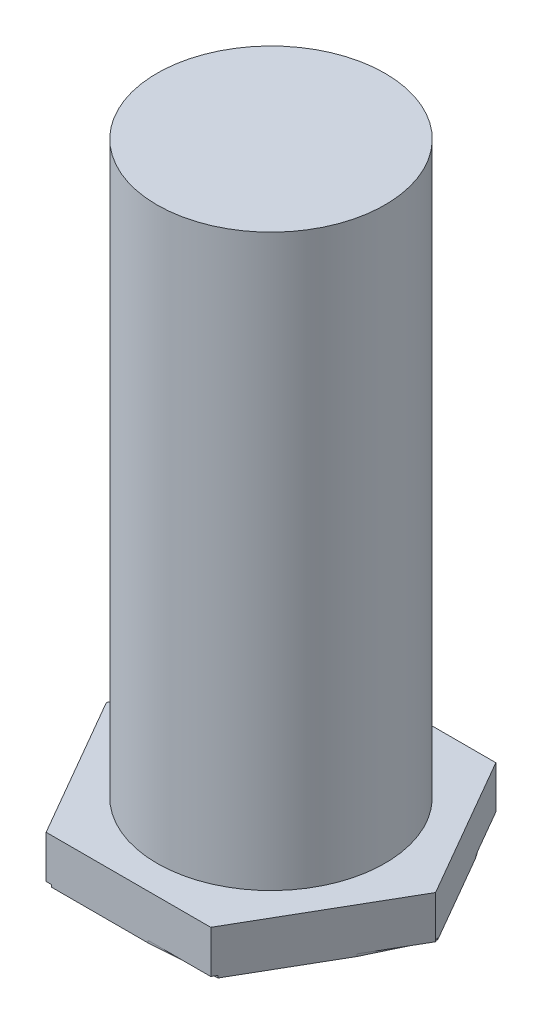
ISO-10303-21;
HEADER;
FILE_DESCRIPTION(('STEP AP214'),'2;1');
FILE_NAME('part.step','',(''),(''),'','','');
FILE_SCHEMA(('AUTOMOTIVE_DESIGN { 1 0 10303 214 1 1 1 1 }'));
ENDSEC;
DATA;
#1=APPLICATION_CONTEXT('core data for automotive mechanical design processes');
#2=APPLICATION_PROTOCOL_DEFINITION('international standard','automotive_design',2000,#1);
#3=PRODUCT_CONTEXT('',#1,'mechanical');
#4=PRODUCT('Part','Part','',(#3));
#5=PRODUCT_RELATED_PRODUCT_CATEGORY('part','',(#4));
#6=PRODUCT_DEFINITION_FORMATION('','',#4);
#7=PRODUCT_DEFINITION_CONTEXT('part definition',#1,'design');
#8=PRODUCT_DEFINITION('design','',#6,#7);
#9=PRODUCT_DEFINITION_SHAPE('','',#8);
#10=(LENGTH_UNIT() NAMED_UNIT(*) SI_UNIT(.MILLI.,.METRE.));
#11=(NAMED_UNIT(*) PLANE_ANGLE_UNIT() SI_UNIT($,.RADIAN.));
#12=(NAMED_UNIT(*) SI_UNIT($,.STERADIAN.) SOLID_ANGLE_UNIT());
#13=UNCERTAINTY_MEASURE_WITH_UNIT(LENGTH_MEASURE(1.E-05),#10,'distance_accuracy_value','');
#14=(GEOMETRIC_REPRESENTATION_CONTEXT(3) GLOBAL_UNCERTAINTY_ASSIGNED_CONTEXT((#13)) GLOBAL_UNIT_ASSIGNED_CONTEXT((#10,
#11,#12)) REPRESENTATION_CONTEXT('',''));
#15=CARTESIAN_POINT('',(0.,0.,0.));
#16=DIRECTION('',(0.,0.,1.));
#17=DIRECTION('',(1.,0.,0.));
#18=AXIS2_PLACEMENT_3D('',#15,#16,#17);
#19=CARTESIAN_POINT('',(0.,25.4,0.));
#20=DIRECTION('',(0.,-1.,0.));
#21=DIRECTION('',(0.,0.,-1.));
#22=AXIS2_PLACEMENT_3D('',#19,#20,#21);
#23=CYLINDRICAL_SURFACE('',#22,5.08);
#24=CARTESIAN_POINT('',(0.,25.4,0.));
#25=DIRECTION('',(0.,1.,0.));
#26=DIRECTION('',(0.,0.,1.));
#27=AXIS2_PLACEMENT_3D('',#24,#25,#26);
#28=CIRCLE('',#27,5.08);
#29=CARTESIAN_POINT('',(0.,25.4,5.08));
#30=VERTEX_POINT('',#29);
#31=EDGE_CURVE('E11',#30,#30,#28,.T.);
#32=ORIENTED_EDGE('',*,*,#31,.F.);
#33=EDGE_LOOP('',(#32));
#34=FACE_BOUND('',#33,.T.);
#35=CARTESIAN_POINT('',(0.,0.,0.));
#36=DIRECTION('',(0.,1.,0.));
#37=DIRECTION('',(0.,0.,1.));
#38=AXIS2_PLACEMENT_3D('',#35,#36,#37);
#39=CIRCLE('',#38,5.08);
#40=CARTESIAN_POINT('',(0.,0.,5.08));
#41=VERTEX_POINT('',#40);
#42=EDGE_CURVE('E42',#41,#41,#39,.T.);
#43=ORIENTED_EDGE('',*,*,#42,.T.);
#44=EDGE_LOOP('',(#43));
#45=FACE_BOUND('',#44,.T.);
#46=ADVANCED_FACE('F39',(#34,#45),#23,.T.);
#47=CARTESIAN_POINT('',(0.,25.4,0.));
#48=DIRECTION('',(0.,1.,0.));
#49=DIRECTION('',(0.,0.,1.));
#50=AXIS2_PLACEMENT_3D('',#47,#48,#49);
#51=PLANE('',#50);
#52=ORIENTED_EDGE('',*,*,#31,.T.);
#53=EDGE_LOOP('',(#52));
#54=FACE_BOUND('',#53,.T.);
#55=ADVANCED_FACE('F416',(#54),#51,.T.);
#56=CARTESIAN_POINT('',(-3.66617420935413,-2.,6.35));
#57=DIRECTION('',(0.866025403784439,0.,-0.5));
#58=DIRECTION('',(-0.5,0.,-0.866025403784439));
#59=AXIS2_PLACEMENT_3D('',#56,#57,#58);
#60=PLANE('',#59);
#61=DIRECTION('',(-0.500000000000006,0.,-0.866025403784435));
#62=VECTOR('',#61,1.);
#63=CARTESIAN_POINT('',(-7.33234841870825,-1.9,0.));
#64=LINE('',#63,#62);
#65=CARTESIAN_POINT('',(-7.21094186725373,-1.9,0.210282315490945));
#66=VERTEX_POINT('',#65);
#67=CARTESIAN_POINT('',(-7.33234841870825,-1.9,0.));
#68=VERTEX_POINT('',#67);
#69=EDGE_CURVE('E266',#66,#68,#64,.T.);
#70=ORIENTED_EDGE('',*,*,#69,.F.);
#71=DIRECTION('',(0.,-1.,0.));
#72=VECTOR('',#71,1.);
#73=CARTESIAN_POINT('',(-7.21094186725373,-1.9,0.210282315490945));
#74=LINE('',#73,#72);
#75=CARTESIAN_POINT('',(-7.21094186725373,-2.,0.210282315490945));
#76=VERTEX_POINT('',#75);
#77=EDGE_CURVE('E251',#66,#76,#74,.T.);
#78=ORIENTED_EDGE('',*,*,#77,.T.);
#79=DIRECTION('',(-0.5,0.,-0.866025403784438));
#80=VECTOR('',#79,1.);
#81=CARTESIAN_POINT('',(-3.66617420935413,-2.,6.35));
#82=LINE('',#81,#80);
#83=CARTESIAN_POINT('',(-4.97956213715095,-2.,4.07514537900829));
#84=VERTEX_POINT('',#83);
#85=EDGE_CURVE('E297',#84,#76,#82,.T.);
#86=ORIENTED_EDGE('',*,*,#85,.F.);
#87=DIRECTION('',(0.,-1.,0.));
#88=VECTOR('',#87,1.);
#89=CARTESIAN_POINT('',(-4.97956213715102,-1.9,4.07514537900817));
#90=LINE('',#89,#88);
#91=CARTESIAN_POINT('',(-4.97956213715102,-1.9,4.07514537900817));
#92=VERTEX_POINT('',#91);
#93=EDGE_CURVE('E288',#92,#84,#90,.T.);
#94=ORIENTED_EDGE('',*,*,#93,.F.);
#95=DIRECTION('',(-0.5,0.,-0.866025403784439));
#96=VECTOR('',#95,1.);
#97=CARTESIAN_POINT('',(-3.66617420935413,-1.9,6.35));
#98=LINE('',#97,#96);
#99=CARTESIAN_POINT('',(-3.66617420935413,-1.9,6.35));
#100=VERTEX_POINT('',#99);
#101=EDGE_CURVE('E277',#100,#92,#98,.T.);
#102=ORIENTED_EDGE('',*,*,#101,.F.);
#103=DIRECTION('',(0.,1.,0.));
#104=VECTOR('',#103,1.);
#105=CARTESIAN_POINT('',(-3.66617420935413,-2.,6.35));
#106=LINE('',#105,#104);
#107=CARTESIAN_POINT('',(-3.66617420935413,0.,6.35));
#108=VERTEX_POINT('',#107);
#109=EDGE_CURVE('E320',#100,#108,#106,.T.);
#110=ORIENTED_EDGE('',*,*,#109,.T.);
#111=DIRECTION('',(-0.5,0.,-0.866025403784438));
#112=VECTOR('',#111,1.);
#113=CARTESIAN_POINT('',(-3.66617420935413,0.,6.35));
#114=LINE('',#113,#112);
#115=CARTESIAN_POINT('',(-7.33234841870825,0.,0.));
#116=VERTEX_POINT('',#115);
#117=EDGE_CURVE('E294',#108,#116,#114,.T.);
#118=ORIENTED_EDGE('',*,*,#117,.T.);
#119=DIRECTION('',(0.,1.,0.));
#120=VECTOR('',#119,1.);
#121=CARTESIAN_POINT('',(-7.33234841870825,-2.,0.));
#122=LINE('',#121,#120);
#123=EDGE_CURVE('E357',#68,#116,#122,.T.);
#124=ORIENTED_EDGE('',*,*,#123,.F.);
#125=EDGE_LOOP('',(#70,#78,#86,#94,#102,#110,#118,#124));
#126=FACE_BOUND('',#125,.T.);
#127=ADVANCED_FACE('F380',(#126),#60,.F.);
#128=CARTESIAN_POINT('',(-7.33234841870825,-2.,0.));
#129=DIRECTION('',(0.866025403784439,0.,0.5));
#130=DIRECTION('',(0.5,0.,-0.866025403784439));
#131=AXIS2_PLACEMENT_3D('',#128,#129,#130);
#132=PLANE('',#131);
#133=DIRECTION('',(0.5,0.,-0.866025403784439));
#134=VECTOR('',#133,1.);
#135=CARTESIAN_POINT('',(-7.33234841870825,-2.,0.));
#136=LINE('',#135,#134);
#137=CARTESIAN_POINT('',(-6.07045658023057,-2.,-2.18566077789983));
#138=VERTEX_POINT('',#137);
#139=CARTESIAN_POINT('',(-3.78759409930868,-2.,-6.13969458154929));
#140=VERTEX_POINT('',#139);
#141=EDGE_CURVE('E301',#138,#140,#136,.T.);
#142=ORIENTED_EDGE('',*,*,#141,.F.);
#143=DIRECTION('',(0.,-1.,0.));
#144=VECTOR('',#143,1.);
#145=CARTESIAN_POINT('',(-6.07045658023058,-1.9,-2.18566077789981));
#146=LINE('',#145,#144);
#147=CARTESIAN_POINT('',(-6.07045658023058,-1.9,-2.18566077789981));
#148=VERTEX_POINT('',#147);
#149=EDGE_CURVE('E269',#148,#138,#146,.T.);
#150=ORIENTED_EDGE('',*,*,#149,.F.);
#151=DIRECTION('',(0.5,0.,-0.866025403784438));
#152=VECTOR('',#151,1.);
#153=CARTESIAN_POINT('',(-6.07045658023058,-1.9,-2.18566077789981));
#154=LINE('',#153,#152);
#155=EDGE_CURVE('E257',#68,#148,#154,.T.);
#156=ORIENTED_EDGE('',*,*,#155,.F.);
#157=ORIENTED_EDGE('',*,*,#123,.T.);
#158=DIRECTION('',(0.5,0.,-0.866025403784439));
#159=VECTOR('',#158,1.);
#160=CARTESIAN_POINT('',(-7.33234841870825,0.,0.));
#161=LINE('',#160,#159);
#162=CARTESIAN_POINT('',(-3.66617420935413,0.,-6.35));
#163=VERTEX_POINT('',#162);
#164=EDGE_CURVE('E324',#116,#163,#161,.T.);
#165=ORIENTED_EDGE('',*,*,#164,.T.);
#166=DIRECTION('',(0.,1.,0.));
#167=VECTOR('',#166,1.);
#168=CARTESIAN_POINT('',(-3.66617420935413,-2.,-6.35));
#169=LINE('',#168,#167);
#170=CARTESIAN_POINT('',(-3.66617420935413,-1.9,-6.35));
#171=VERTEX_POINT('',#170);
#172=EDGE_CURVE('E354',#171,#163,#169,.T.);
#173=ORIENTED_EDGE('',*,*,#172,.F.);
#174=DIRECTION('',(0.499999999999995,0.,-0.866025403784442));
#175=VECTOR('',#174,1.);
#176=CARTESIAN_POINT('',(-3.78759409930868,-1.9,-6.13969458154929));
#177=LINE('',#176,#175);
#178=CARTESIAN_POINT('',(-3.78759409930868,-1.9,-6.13969458154929));
#179=VERTEX_POINT('',#178);
#180=EDGE_CURVE('E245',#179,#171,#177,.T.);
#181=ORIENTED_EDGE('',*,*,#180,.F.);
#182=DIRECTION('',(0.,-1.,0.));
#183=VECTOR('',#182,1.);
#184=CARTESIAN_POINT('',(-3.78759409930868,-1.9,-6.13969458154929));
#185=LINE('',#184,#183);
#186=EDGE_CURVE('E230',#179,#140,#185,.T.);
#187=ORIENTED_EDGE('',*,*,#186,.T.);
#188=EDGE_LOOP('',(#142,#150,#156,#157,#165,#173,#181,#187));
#189=FACE_BOUND('',#188,.T.);
#190=ADVANCED_FACE('F407',(#189),#132,.F.);
#191=CARTESIAN_POINT('',(-3.66617420935413,-2.,-6.35));
#192=DIRECTION('',(0.,0.,1.));
#193=DIRECTION('',(1.,0.,0.));
#194=AXIS2_PLACEMENT_3D('',#191,#192,#193);
#195=PLANE('',#194);
#196=DIRECTION('',(1.,0.,0.));
#197=VECTOR('',#196,1.);
#198=CARTESIAN_POINT('',(-3.66617420935413,-2.,-6.35));
#199=LINE('',#198,#197);
#200=CARTESIAN_POINT('',(-1.14744564717966,-2.,-6.35));
#201=VERTEX_POINT('',#200);
#202=CARTESIAN_POINT('',(3.42320375409706,-2.,-6.35));
#203=VERTEX_POINT('',#202);
#204=EDGE_CURVE('E306',#201,#203,#199,.T.);
#205=ORIENTED_EDGE('',*,*,#204,.F.);
#206=DIRECTION('',(0.,-1.,0.));
#207=VECTOR('',#206,1.);
#208=CARTESIAN_POINT('',(-1.14744564717976,-1.9,-6.35));
#209=LINE('',#208,#207);
#210=CARTESIAN_POINT('',(-1.14744564717976,-1.9,-6.35));
#211=VERTEX_POINT('',#210);
#212=EDGE_CURVE('E248',#211,#201,#209,.T.);
#213=ORIENTED_EDGE('',*,*,#212,.F.);
#214=DIRECTION('',(1.,0.,0.));
#215=VECTOR('',#214,1.);
#216=CARTESIAN_POINT('',(-3.66617420935413,-1.9,-6.35));
#217=LINE('',#216,#215);
#218=EDGE_CURVE('E236',#171,#211,#217,.T.);
#219=ORIENTED_EDGE('',*,*,#218,.F.);
#220=ORIENTED_EDGE('',*,*,#172,.T.);
#221=DIRECTION('',(1.,0.,0.));
#222=VECTOR('',#221,1.);
#223=CARTESIAN_POINT('',(-3.66617420935413,0.,-6.35));
#224=LINE('',#223,#222);
#225=CARTESIAN_POINT('',(3.66617420935412,0.,-6.35));
#226=VERTEX_POINT('',#225);
#227=EDGE_CURVE('E328',#163,#226,#224,.T.);
#228=ORIENTED_EDGE('',*,*,#227,.T.);
#229=DIRECTION('',(0.,1.,0.));
#230=VECTOR('',#229,1.);
#231=CARTESIAN_POINT('',(3.66617420935412,-2.,-6.35));
#232=LINE('',#231,#230);
#233=CARTESIAN_POINT('',(3.66617420935412,-1.9,-6.35));
#234=VERTEX_POINT('',#233);
#235=EDGE_CURVE('E351',#234,#226,#232,.T.);
#236=ORIENTED_EDGE('',*,*,#235,.F.);
#237=DIRECTION('',(1.,0.,0.));
#238=VECTOR('',#237,1.);
#239=CARTESIAN_POINT('',(3.66617420935412,-1.9,-6.35));
#240=LINE('',#239,#238);
#241=CARTESIAN_POINT('',(3.42320375409706,-1.9,-6.35));
#242=VERTEX_POINT('',#241);
#243=EDGE_CURVE('E224',#242,#234,#240,.T.);
#244=ORIENTED_EDGE('',*,*,#243,.F.);
#245=DIRECTION('',(0.,-1.,0.));
#246=VECTOR('',#245,1.);
#247=CARTESIAN_POINT('',(3.42320375409706,-1.9,-6.35));
#248=LINE('',#247,#246);
#249=EDGE_CURVE('E208',#242,#203,#248,.T.);
#250=ORIENTED_EDGE('',*,*,#249,.T.);
#251=EDGE_LOOP('',(#205,#213,#219,#220,#228,#236,#244,#250));
#252=FACE_BOUND('',#251,.T.);
#253=ADVANCED_FACE('F401',(#252),#195,.F.);
#254=CARTESIAN_POINT('',(3.66617420935412,-2.,-6.35));
#255=DIRECTION('',(-0.866025403784439,0.,0.5));
#256=DIRECTION('',(0.5,0.,0.866025403784439));
#257=AXIS2_PLACEMENT_3D('',#254,#255,#256);
#258=PLANE('',#257);
#259=DIRECTION('',(0.5,0.,0.866025403784438));
#260=VECTOR('',#259,1.);
#261=CARTESIAN_POINT('',(3.66617420935412,-2.,-6.35));
#262=LINE('',#261,#260);
#263=CARTESIAN_POINT('',(4.91331884959129,-2.,-4.18988211872199));
#264=VERTEX_POINT('',#263);
#265=CARTESIAN_POINT('',(7.21103458263856,-2.,-0.210121727733769));
#266=VERTEX_POINT('',#265);
#267=EDGE_CURVE('E310',#264,#266,#262,.T.);
#268=ORIENTED_EDGE('',*,*,#267,.F.);
#269=DIRECTION('',(0.,-1.,0.));
#270=VECTOR('',#269,1.);
#271=CARTESIAN_POINT('',(4.91331884959143,-1.9,-4.18988211872177));
#272=LINE('',#271,#270);
#273=CARTESIAN_POINT('',(4.91331884959143,-1.9,-4.18988211872177));
#274=VERTEX_POINT('',#273);
#275=EDGE_CURVE('E227',#274,#264,#272,.T.);
#276=ORIENTED_EDGE('',*,*,#275,.F.);
#277=DIRECTION('',(0.5,0.,0.866025403784439));
#278=VECTOR('',#277,1.);
#279=CARTESIAN_POINT('',(4.91331884959143,-1.9,-4.18988211872177));
#280=LINE('',#279,#278);
#281=EDGE_CURVE('E215',#234,#274,#280,.T.);
#282=ORIENTED_EDGE('',*,*,#281,.F.);
#283=ORIENTED_EDGE('',*,*,#235,.T.);
#284=DIRECTION('',(0.5,0.,0.866025403784438));
#285=VECTOR('',#284,1.);
#286=CARTESIAN_POINT('',(3.66617420935412,0.,-6.35));
#287=LINE('',#286,#285);
#288=CARTESIAN_POINT('',(7.33234841870825,0.,0.));
#289=VERTEX_POINT('',#288);
#290=EDGE_CURVE('E332',#226,#289,#287,.T.);
#291=ORIENTED_EDGE('',*,*,#290,.T.);
#292=DIRECTION('',(0.,1.,0.));
#293=VECTOR('',#292,1.);
#294=CARTESIAN_POINT('',(7.33234841870825,-2.,0.));
#295=LINE('',#294,#293);
#296=CARTESIAN_POINT('',(7.33234841870825,-1.9,0.));
#297=VERTEX_POINT('',#296);
#298=EDGE_CURVE('E348',#297,#289,#295,.T.);
#299=ORIENTED_EDGE('',*,*,#298,.F.);
#300=DIRECTION('',(0.500000000000002,0.,0.866025403784438));
#301=VECTOR('',#300,1.);
#302=CARTESIAN_POINT('',(7.21103458263856,-1.9,-0.210121727733769));
#303=LINE('',#302,#301);
#304=CARTESIAN_POINT('',(7.21103458263856,-1.9,-0.210121727733769));
#305=VERTEX_POINT('',#304);
#306=EDGE_CURVE('E203',#305,#297,#303,.T.);
#307=ORIENTED_EDGE('',*,*,#306,.F.);
#308=DIRECTION('',(0.,-1.,0.));
#309=VECTOR('',#308,1.);
#310=CARTESIAN_POINT('',(7.21103458263856,-1.9,-0.210121727733769));
#311=LINE('',#310,#309);
#312=EDGE_CURVE('E209',#305,#266,#311,.T.);
#313=ORIENTED_EDGE('',*,*,#312,.T.);
#314=EDGE_LOOP('',(#268,#276,#282,#283,#291,#299,#307,#313));
#315=FACE_BOUND('',#314,.T.);
#316=ADVANCED_FACE('F393',(#315),#258,.F.);
#317=CARTESIAN_POINT('',(7.33234841870825,-2.,0.));
#318=DIRECTION('',(-0.866025403784439,0.,-0.5));
#319=DIRECTION('',(-0.5,0.,0.866025403784439));
#320=AXIS2_PLACEMENT_3D('',#317,#318,#319);
#321=PLANE('',#320);
#322=DIRECTION('',(-0.5,0.,0.866025403784439));
#323=VECTOR('',#322,1.);
#324=CARTESIAN_POINT('',(7.33234841870825,-2.,0.));
#325=LINE('',#324,#323);
#326=CARTESIAN_POINT('',(6.05256982189205,-2.,2.21664155212486));
#327=VERTEX_POINT('',#326);
#328=CARTESIAN_POINT('',(3.78693067363508,-2.,6.140843668523));
#329=VERTEX_POINT('',#328);
#330=EDGE_CURVE('E314',#327,#329,#325,.T.);
#331=ORIENTED_EDGE('',*,*,#330,.F.);
#332=DIRECTION('',(0.,-1.,0.));
#333=VECTOR('',#332,1.);
#334=CARTESIAN_POINT('',(6.05256982189207,-1.9,2.21664155212483));
#335=LINE('',#334,#333);
#336=CARTESIAN_POINT('',(6.05256982189207,-1.9,2.21664155212483));
#337=VERTEX_POINT('',#336);
#338=EDGE_CURVE('E62',#337,#327,#335,.T.);
#339=ORIENTED_EDGE('',*,*,#338,.F.);
#340=DIRECTION('',(-0.5,0.,0.866025403784438));
#341=VECTOR('',#340,1.);
#342=CARTESIAN_POINT('',(6.05256982189207,-1.9,2.21664155212483));
#343=LINE('',#342,#341);
#344=EDGE_CURVE('E194',#297,#337,#343,.T.);
#345=ORIENTED_EDGE('',*,*,#344,.F.);
#346=ORIENTED_EDGE('',*,*,#298,.T.);
#347=DIRECTION('',(-0.5,0.,0.866025403784439));
#348=VECTOR('',#347,1.);
#349=CARTESIAN_POINT('',(7.33234841870825,0.,0.));
#350=LINE('',#349,#348);
#351=CARTESIAN_POINT('',(3.66617420935413,0.,6.35));
#352=VERTEX_POINT('',#351);
#353=EDGE_CURVE('E336',#289,#352,#350,.T.);
#354=ORIENTED_EDGE('',*,*,#353,.T.);
#355=DIRECTION('',(0.,1.,0.));
#356=VECTOR('',#355,1.);
#357=CARTESIAN_POINT('',(3.66617420935413,-2.,6.35));
#358=LINE('',#357,#356);
#359=CARTESIAN_POINT('',(3.66617420935413,-1.9,6.35));
#360=VERTEX_POINT('',#359);
#361=EDGE_CURVE('E345',#360,#352,#358,.T.);
#362=ORIENTED_EDGE('',*,*,#361,.F.);
#363=DIRECTION('',(-0.499999999999989,0.,0.866025403784445));
#364=VECTOR('',#363,1.);
#365=CARTESIAN_POINT('',(3.66617420935413,-1.9,6.35));
#366=LINE('',#365,#364);
#367=CARTESIAN_POINT('',(3.78693067363508,-1.9,6.140843668523));
#368=VERTEX_POINT('',#367);
#369=EDGE_CURVE('E170',#368,#360,#366,.T.);
#370=ORIENTED_EDGE('',*,*,#369,.F.);
#371=DIRECTION('',(0.,-1.,0.));
#372=VECTOR('',#371,1.);
#373=CARTESIAN_POINT('',(3.78693067363508,-1.9,6.140843668523));
#374=LINE('',#373,#372);
#375=EDGE_CURVE('E166',#368,#329,#374,.T.);
#376=ORIENTED_EDGE('',*,*,#375,.T.);
#377=EDGE_LOOP('',(#331,#339,#345,#346,#354,#362,#370,#376));
#378=FACE_BOUND('',#377,.T.);
#379=ADVANCED_FACE('F387',(#378),#321,.F.);
#380=CARTESIAN_POINT('',(3.66617420935413,-2.,6.35));
#381=DIRECTION('',(0.,0.,-1.));
#382=DIRECTION('',(-1.,0.,0.));
#383=AXIS2_PLACEMENT_3D('',#380,#381,#382);
#384=PLANE('',#383);
#385=DIRECTION('',(-1.,0.,0.));
#386=VECTOR('',#385,1.);
#387=CARTESIAN_POINT('',(3.66617420935413,-2.,6.35));
#388=LINE('',#387,#386);
#389=CARTESIAN_POINT('',(0.865199259962073,-2.,6.35));
#390=VERTEX_POINT('',#389);
#391=CARTESIAN_POINT('',(-3.42387978841072,-2.,6.35));
#392=VERTEX_POINT('',#391);
#393=EDGE_CURVE('E184',#390,#392,#388,.T.);
#394=ORIENTED_EDGE('',*,*,#393,.F.);
#395=DIRECTION('',(0.,-1.,0.));
#396=VECTOR('',#395,1.);
#397=CARTESIAN_POINT('',(0.865199259961985,-1.9,6.35));
#398=LINE('',#397,#396);
#399=CARTESIAN_POINT('',(0.865199259961985,-1.9,6.35));
#400=VERTEX_POINT('',#399);
#401=EDGE_CURVE('E54',#400,#390,#398,.T.);
#402=ORIENTED_EDGE('',*,*,#401,.F.);
#403=DIRECTION('',(-1.,0.,0.));
#404=VECTOR('',#403,1.);
#405=CARTESIAN_POINT('',(0.865199259961985,-1.9,6.35));
#406=LINE('',#405,#404);
#407=EDGE_CURVE('E171',#360,#400,#406,.T.);
#408=ORIENTED_EDGE('',*,*,#407,.F.);
#409=ORIENTED_EDGE('',*,*,#361,.T.);
#410=DIRECTION('',(-1.,0.,0.));
#411=VECTOR('',#410,1.);
#412=CARTESIAN_POINT('',(3.66617420935413,0.,6.35));
#413=LINE('',#412,#411);
#414=EDGE_CURVE('E302',#352,#108,#413,.T.);
#415=ORIENTED_EDGE('',*,*,#414,.T.);
#416=ORIENTED_EDGE('',*,*,#109,.F.);
#417=DIRECTION('',(-1.,0.,0.));
#418=VECTOR('',#417,1.);
#419=CARTESIAN_POINT('',(-3.42387978841072,-1.9,6.35));
#420=LINE('',#419,#418);
#421=CARTESIAN_POINT('',(-3.42387978841072,-1.9,6.35));
#422=VERTEX_POINT('',#421);
#423=EDGE_CURVE('E285',#422,#100,#420,.T.);
#424=ORIENTED_EDGE('',*,*,#423,.F.);
#425=DIRECTION('',(0.,-1.,0.));
#426=VECTOR('',#425,1.);
#427=CARTESIAN_POINT('',(-3.42387978841072,-1.9,6.35));
#428=LINE('',#427,#426);
#429=EDGE_CURVE('E291',#422,#392,#428,.T.);
#430=ORIENTED_EDGE('',*,*,#429,.T.);
#431=EDGE_LOOP('',(#394,#402,#408,#409,#415,#416,#424,#430));
#432=FACE_BOUND('',#431,.T.);
#433=ADVANCED_FACE('F181',(#432),#384,.F.);
#434=CARTESIAN_POINT('',(0.,-2.,0.));
#435=DIRECTION('',(0.,-1.,0.));
#436=DIRECTION('',(0.,0.,-1.));
#437=AXIS2_PLACEMENT_3D('',#434,#435,#436);
#438=PLANE('',#437);
#439=DIRECTION('',(-0.429798410427616,0.,0.902924873061926));
#440=VECTOR('',#439,1.);
#441=CARTESIAN_POINT('',(-6.07045658023058,-2.,-2.18566077789981));
#442=LINE('',#441,#440);
#443=EDGE_CURVE('E262',#138,#76,#442,.T.);
#444=ORIENTED_EDGE('',*,*,#443,.F.);
#445=ORIENTED_EDGE('',*,*,#141,.T.);
#446=DIRECTION('',(-0.996842426549787,0.,0.0794051423418738));
#447=VECTOR('',#446,1.);
#448=CARTESIAN_POINT('',(-1.14744564717976,-2.,-6.35));
#449=LINE('',#448,#447);
#450=EDGE_CURVE('E241',#201,#140,#449,.T.);
#451=ORIENTED_EDGE('',*,*,#450,.F.);
#452=ORIENTED_EDGE('',*,*,#204,.T.);
#453=DIRECTION('',(-0.567830728036156,0.,-0.823145348221035));
#454=VECTOR('',#453,1.);
#455=CARTESIAN_POINT('',(4.91331884959143,-2.,-4.18988211872177));
#456=LINE('',#455,#454);
#457=EDGE_CURVE('E220',#264,#203,#456,.T.);
#458=ORIENTED_EDGE('',*,*,#457,.F.);
#459=ORIENTED_EDGE('',*,*,#267,.T.);
#460=DIRECTION('',(0.430801316408469,0.,-0.90244679941852));
#461=VECTOR('',#460,1.);
#462=CARTESIAN_POINT('',(6.05256982189207,-2.,2.21664155212483));
#463=LINE('',#462,#461);
#464=EDGE_CURVE('E199',#327,#266,#463,.T.);
#465=ORIENTED_EDGE('',*,*,#464,.F.);
#466=ORIENTED_EDGE('',*,*,#330,.T.);
#467=DIRECTION('',(0.997447497541288,0.,-0.0714037089276369));
#468=VECTOR('',#467,1.);
#469=CARTESIAN_POINT('',(0.865199259961985,-2.,6.35));
#470=LINE('',#469,#468);
#471=EDGE_CURVE('E178',#390,#329,#470,.T.);
#472=ORIENTED_EDGE('',*,*,#471,.F.);
#473=ORIENTED_EDGE('',*,*,#393,.T.);
#474=DIRECTION('',(0.564486887468435,0.,0.825442035442949));
#475=VECTOR('',#474,1.);
#476=CARTESIAN_POINT('',(-4.97956213715102,-2.,4.07514537900817));
#477=LINE('',#476,#475);
#478=EDGE_CURVE('E189',#84,#392,#477,.T.);
#479=ORIENTED_EDGE('',*,*,#478,.F.);
#480=ORIENTED_EDGE('',*,*,#85,.T.);
#481=EDGE_LOOP('',(#444,#445,#451,#452,#458,#459,#465,#466,#472,#473,#479,#480));
#482=FACE_BOUND('',#481,.T.);
#483=ADVANCED_FACE('F372',(#482),#438,.T.);
#484=CARTESIAN_POINT('',(0.,0.,0.));
#485=DIRECTION('',(0.,-1.,0.));
#486=DIRECTION('',(0.,0.,-1.));
#487=AXIS2_PLACEMENT_3D('',#484,#485,#486);
#488=PLANE('',#487);
#489=ORIENTED_EDGE('',*,*,#42,.F.);
#490=EDGE_LOOP('',(#489));
#491=FACE_BOUND('',#490,.T.);
#492=ORIENTED_EDGE('',*,*,#117,.F.);
#493=ORIENTED_EDGE('',*,*,#414,.F.);
#494=ORIENTED_EDGE('',*,*,#353,.F.);
#495=ORIENTED_EDGE('',*,*,#290,.F.);
#496=ORIENTED_EDGE('',*,*,#227,.F.);
#497=ORIENTED_EDGE('',*,*,#164,.F.);
#498=EDGE_LOOP('',(#492,#493,#494,#495,#496,#497));
#499=FACE_BOUND('',#498,.T.);
#500=ADVANCED_FACE('F368',(#491,#499),#488,.F.);
#501=CARTESIAN_POINT('',(-4.97956213715102,-1.9,4.07514537900817));
#502=DIRECTION('',(0.825442035442949,0.,-0.564486887468435));
#503=DIRECTION('',(-0.564486887468435,0.,-0.825442035442949));
#504=AXIS2_PLACEMENT_3D('',#501,#502,#503);
#505=PLANE('',#504);
#506=ORIENTED_EDGE('',*,*,#478,.T.);
#507=ORIENTED_EDGE('',*,*,#429,.F.);
#508=DIRECTION('',(0.564486887468435,0.,0.825442035442949));
#509=VECTOR('',#508,1.);
#510=CARTESIAN_POINT('',(-4.97956213715102,-1.9,4.07514537900817));
#511=LINE('',#510,#509);
#512=EDGE_CURVE('E281',#92,#422,#511,.T.);
#513=ORIENTED_EDGE('',*,*,#512,.F.);
#514=ORIENTED_EDGE('',*,*,#93,.T.);
#515=EDGE_LOOP('',(#506,#507,#513,#514));
#516=FACE_BOUND('',#515,.T.);
#517=ADVANCED_FACE('F371',(#516),#505,.F.);
#518=CARTESIAN_POINT('',(0.,-1.9,0.));
#519=DIRECTION('',(0.,1.,0.));
#520=DIRECTION('',(0.,0.,1.));
#521=AXIS2_PLACEMENT_3D('',#518,#519,#520);
#522=PLANE('',#521);
#523=ORIENTED_EDGE('',*,*,#101,.T.);
#524=ORIENTED_EDGE('',*,*,#512,.T.);
#525=ORIENTED_EDGE('',*,*,#423,.T.);
#526=EDGE_LOOP('',(#523,#524,#525));
#527=FACE_BOUND('',#526,.T.);
#528=ADVANCED_FACE('F486',(#527),#522,.F.);
#529=CARTESIAN_POINT('',(0.865199259961985,-1.9,6.35));
#530=DIRECTION('',(-0.0714037089276369,0.,-0.997447497541288));
#531=DIRECTION('',(-0.997447497541288,0.,0.0714037089276369));
#532=AXIS2_PLACEMENT_3D('',#529,#530,#531);
#533=PLANE('',#532);
#534=ORIENTED_EDGE('',*,*,#471,.T.);
#535=ORIENTED_EDGE('',*,*,#375,.F.);
#536=DIRECTION('',(0.997447497541288,0.,-0.0714037089276369));
#537=VECTOR('',#536,1.);
#538=CARTESIAN_POINT('',(0.865199259961985,-1.9,6.35));
#539=LINE('',#538,#537);
#540=EDGE_CURVE('E162',#400,#368,#539,.T.);
#541=ORIENTED_EDGE('',*,*,#540,.F.);
#542=ORIENTED_EDGE('',*,*,#401,.T.);
#543=EDGE_LOOP('',(#534,#535,#541,#542));
#544=FACE_BOUND('',#543,.T.);
#545=ADVANCED_FACE('F164',(#544),#533,.F.);
#546=CARTESIAN_POINT('',(0.,-1.9,0.));
#547=DIRECTION('',(0.,1.,0.));
#548=DIRECTION('',(0.,0.,1.));
#549=AXIS2_PLACEMENT_3D('',#546,#547,#548);
#550=PLANE('',#549);
#551=ORIENTED_EDGE('',*,*,#407,.T.);
#552=ORIENTED_EDGE('',*,*,#540,.T.);
#553=ORIENTED_EDGE('',*,*,#369,.T.);
#554=EDGE_LOOP('',(#551,#552,#553));
#555=FACE_BOUND('',#554,.T.);
#556=ADVANCED_FACE('F174',(#555),#550,.F.);
#557=CARTESIAN_POINT('',(6.05256982189207,-1.9,2.21664155212483));
#558=DIRECTION('',(-0.90244679941852,0.,-0.430801316408469));
#559=DIRECTION('',(-0.430801316408469,0.,0.90244679941852));
#560=AXIS2_PLACEMENT_3D('',#557,#558,#559);
#561=PLANE('',#560);
#562=ORIENTED_EDGE('',*,*,#464,.T.);
#563=ORIENTED_EDGE('',*,*,#312,.F.);
#564=DIRECTION('',(0.430801316408469,0.,-0.90244679941852));
#565=VECTOR('',#564,1.);
#566=CARTESIAN_POINT('',(6.05256982189207,-1.9,2.21664155212483));
#567=LINE('',#566,#565);
#568=EDGE_CURVE('E198',#337,#305,#567,.T.);
#569=ORIENTED_EDGE('',*,*,#568,.F.);
#570=ORIENTED_EDGE('',*,*,#338,.T.);
#571=EDGE_LOOP('',(#562,#563,#569,#570));
#572=FACE_BOUND('',#571,.T.);
#573=ADVANCED_FACE('F513',(#572),#561,.F.);
#574=CARTESIAN_POINT('',(0.,-1.9,0.));
#575=DIRECTION('',(0.,-1.,0.));
#576=DIRECTION('',(0.,0.,-1.));
#577=AXIS2_PLACEMENT_3D('',#574,#575,#576);
#578=PLANE('',#577);
#579=ORIENTED_EDGE('',*,*,#344,.T.);
#580=ORIENTED_EDGE('',*,*,#568,.T.);
#581=ORIENTED_EDGE('',*,*,#306,.T.);
#582=EDGE_LOOP('',(#579,#580,#581));
#583=FACE_BOUND('',#582,.T.);
#584=ADVANCED_FACE('F522',(#583),#578,.T.);
#585=CARTESIAN_POINT('',(4.91331884959143,-1.9,-4.18988211872177));
#586=DIRECTION('',(-0.823145348221035,0.,0.567830728036156));
#587=DIRECTION('',(0.567830728036156,0.,0.823145348221035));
#588=AXIS2_PLACEMENT_3D('',#585,#586,#587);
#589=PLANE('',#588);
#590=ORIENTED_EDGE('',*,*,#457,.T.);
#591=ORIENTED_EDGE('',*,*,#249,.F.);
#592=DIRECTION('',(-0.567830728036156,0.,-0.823145348221035));
#593=VECTOR('',#592,1.);
#594=CARTESIAN_POINT('',(4.91331884959143,-1.9,-4.18988211872177));
#595=LINE('',#594,#593);
#596=EDGE_CURVE('E219',#274,#242,#595,.T.);
#597=ORIENTED_EDGE('',*,*,#596,.F.);
#598=ORIENTED_EDGE('',*,*,#275,.T.);
#599=EDGE_LOOP('',(#590,#591,#597,#598));
#600=FACE_BOUND('',#599,.T.);
#601=ADVANCED_FACE('F531',(#600),#589,.F.);
#602=CARTESIAN_POINT('',(0.,-1.9,0.));
#603=DIRECTION('',(0.,1.,0.));
#604=DIRECTION('',(0.,0.,1.));
#605=AXIS2_PLACEMENT_3D('',#602,#603,#604);
#606=PLANE('',#605);
#607=ORIENTED_EDGE('',*,*,#281,.T.);
#608=ORIENTED_EDGE('',*,*,#596,.T.);
#609=ORIENTED_EDGE('',*,*,#243,.T.);
#610=EDGE_LOOP('',(#607,#608,#609));
#611=FACE_BOUND('',#610,.T.);
#612=ADVANCED_FACE('F541',(#611),#606,.F.);
#613=CARTESIAN_POINT('',(-1.14744564717976,-1.9,-6.35));
#614=DIRECTION('',(0.0794051423418738,0.,0.996842426549787));
#615=DIRECTION('',(0.996842426549787,0.,-0.0794051423418738));
#616=AXIS2_PLACEMENT_3D('',#613,#614,#615);
#617=PLANE('',#616);
#618=ORIENTED_EDGE('',*,*,#450,.T.);
#619=ORIENTED_EDGE('',*,*,#186,.F.);
#620=DIRECTION('',(-0.996842426549787,0.,0.0794051423418738));
#621=VECTOR('',#620,1.);
#622=CARTESIAN_POINT('',(-1.14744564717976,-1.9,-6.35));
#623=LINE('',#622,#621);
#624=EDGE_CURVE('E240',#211,#179,#623,.T.);
#625=ORIENTED_EDGE('',*,*,#624,.F.);
#626=ORIENTED_EDGE('',*,*,#212,.T.);
#627=EDGE_LOOP('',(#618,#619,#625,#626));
#628=FACE_BOUND('',#627,.T.);
#629=ADVANCED_FACE('F551',(#628),#617,.F.);
#630=CARTESIAN_POINT('',(0.,-1.9,0.));
#631=DIRECTION('',(0.,1.,0.));
#632=DIRECTION('',(0.,0.,1.));
#633=AXIS2_PLACEMENT_3D('',#630,#631,#632);
#634=PLANE('',#633);
#635=ORIENTED_EDGE('',*,*,#218,.T.);
#636=ORIENTED_EDGE('',*,*,#624,.T.);
#637=ORIENTED_EDGE('',*,*,#180,.T.);
#638=EDGE_LOOP('',(#635,#636,#637));
#639=FACE_BOUND('',#638,.T.);
#640=ADVANCED_FACE('F561',(#639),#634,.F.);
#641=CARTESIAN_POINT('',(-6.07045658023058,-1.9,-2.18566077789981));
#642=DIRECTION('',(0.902924873061926,0.,0.429798410427616));
#643=DIRECTION('',(0.429798410427616,0.,-0.902924873061926));
#644=AXIS2_PLACEMENT_3D('',#641,#642,#643);
#645=PLANE('',#644);
#646=ORIENTED_EDGE('',*,*,#443,.T.);
#647=ORIENTED_EDGE('',*,*,#77,.F.);
#648=DIRECTION('',(-0.429798410427616,0.,0.902924873061926));
#649=VECTOR('',#648,1.);
#650=CARTESIAN_POINT('',(-6.07045658023058,-1.9,-2.18566077789981));
#651=LINE('',#650,#649);
#652=EDGE_CURVE('E261',#148,#66,#651,.T.);
#653=ORIENTED_EDGE('',*,*,#652,.F.);
#654=ORIENTED_EDGE('',*,*,#149,.T.);
#655=EDGE_LOOP('',(#646,#647,#653,#654));
#656=FACE_BOUND('',#655,.T.);
#657=ADVANCED_FACE('F571',(#656),#645,.F.);
#658=CARTESIAN_POINT('',(0.,-1.9,0.));
#659=DIRECTION('',(0.,1.,0.));
#660=DIRECTION('',(0.,0.,1.));
#661=AXIS2_PLACEMENT_3D('',#658,#659,#660);
#662=PLANE('',#661);
#663=ORIENTED_EDGE('',*,*,#155,.T.);
#664=ORIENTED_EDGE('',*,*,#652,.T.);
#665=ORIENTED_EDGE('',*,*,#69,.T.);
#666=EDGE_LOOP('',(#663,#664,#665));
#667=FACE_BOUND('',#666,.T.);
#668=ADVANCED_FACE('F581',(#667),#662,.F.);
#669=CLOSED_SHELL('',(#46,#55,#127,#190,#253,#316,#379,#433,#483,#500,#517,#528,#545,#556,#573,
#584,#601,#612,#629,#640,#657,#668));
#670=MANIFOLD_SOLID_BREP('B2',#669);
#671=ADVANCED_BREP_SHAPE_REPRESENTATION('',(#18,#670),#14);
#672=SHAPE_DEFINITION_REPRESENTATION(#9,#671);
ENDSEC;
END-ISO-10303-21;
